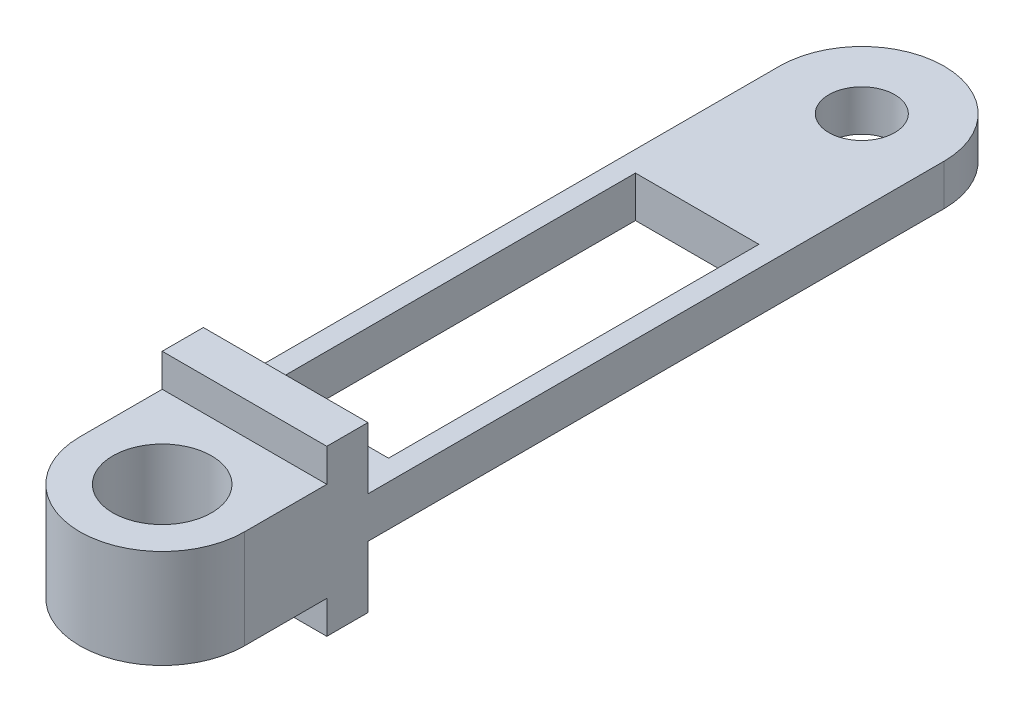
ISO-10303-21;
HEADER;
FILE_DESCRIPTION(('STEP AP214'),'2;1');
FILE_NAME('part.step','',(''),(''),'','','');
FILE_SCHEMA(('AUTOMOTIVE_DESIGN { 1 0 10303 214 1 1 1 1 }'));
ENDSEC;
DATA;
#1=APPLICATION_CONTEXT('core data for automotive mechanical design processes');
#2=APPLICATION_PROTOCOL_DEFINITION('international standard','automotive_design',2000,#1);
#3=PRODUCT_CONTEXT('',#1,'mechanical');
#4=PRODUCT('Part','Part','',(#3));
#5=PRODUCT_RELATED_PRODUCT_CATEGORY('part','',(#4));
#6=PRODUCT_DEFINITION_FORMATION('','',#4);
#7=PRODUCT_DEFINITION_CONTEXT('part definition',#1,'design');
#8=PRODUCT_DEFINITION('design','',#6,#7);
#9=PRODUCT_DEFINITION_SHAPE('','',#8);
#10=(LENGTH_UNIT() NAMED_UNIT(*) SI_UNIT(.MILLI.,.METRE.));
#11=(NAMED_UNIT(*) PLANE_ANGLE_UNIT() SI_UNIT($,.RADIAN.));
#12=(NAMED_UNIT(*) SI_UNIT($,.STERADIAN.) SOLID_ANGLE_UNIT());
#13=UNCERTAINTY_MEASURE_WITH_UNIT(LENGTH_MEASURE(1.E-05),#10,'distance_accuracy_value','');
#14=(GEOMETRIC_REPRESENTATION_CONTEXT(3) GLOBAL_UNCERTAINTY_ASSIGNED_CONTEXT((#13)) GLOBAL_UNIT_ASSIGNED_CONTEXT((#10,
#11,#12)) REPRESENTATION_CONTEXT('',''));
#15=CARTESIAN_POINT('',(0.,0.,0.));
#16=DIRECTION('',(0.,0.,1.));
#17=DIRECTION('',(1.,0.,0.));
#18=AXIS2_PLACEMENT_3D('',#15,#16,#17);
#19=CARTESIAN_POINT('',(0.,0.,5.));
#20=DIRECTION('',(0.,0.,1.));
#21=DIRECTION('',(1.,0.,0.));
#22=AXIS2_PLACEMENT_3D('',#19,#20,#21);
#23=PLANE('',#22);
#24=DIRECTION('',(0.,1.,0.));
#25=VECTOR('',#24,1.);
#26=CARTESIAN_POINT('',(10.,-10.,5.));
#27=LINE('',#26,#25);
#28=CARTESIAN_POINT('',(10.,-10.,5.));
#29=VERTEX_POINT('',#28);
#30=CARTESIAN_POINT('',(10.,-6.,5.));
#31=VERTEX_POINT('',#30);
#32=EDGE_CURVE('E89',#29,#31,#27,.T.);
#33=ORIENTED_EDGE('',*,*,#32,.T.);
#34=DIRECTION('',(-1.,0.,0.));
#35=VECTOR('',#34,1.);
#36=CARTESIAN_POINT('',(-10.,-6.,5.));
#37=LINE('',#36,#35);
#38=CARTESIAN_POINT('',(-9.99999999999999,-6.,5.));
#39=VERTEX_POINT('',#38);
#40=EDGE_CURVE('E225',#31,#39,#37,.T.);
#41=ORIENTED_EDGE('',*,*,#40,.T.);
#42=DIRECTION('',(0.,-1.,0.));
#43=VECTOR('',#42,1.);
#44=CARTESIAN_POINT('',(-9.99999999999999,-10.,5.));
#45=LINE('',#44,#43);
#46=CARTESIAN_POINT('',(-9.99999999999999,-10.,5.));
#47=VERTEX_POINT('',#46);
#48=EDGE_CURVE('E192',#39,#47,#45,.T.);
#49=ORIENTED_EDGE('',*,*,#48,.T.);
#50=DIRECTION('',(1.,0.,0.));
#51=VECTOR('',#50,1.);
#52=CARTESIAN_POINT('',(10.,-10.,5.));
#53=LINE('',#52,#51);
#54=EDGE_CURVE('E191',#47,#29,#53,.T.);
#55=ORIENTED_EDGE('',*,*,#54,.T.);
#56=EDGE_LOOP('',(#33,#41,#49,#55));
#57=FACE_BOUND('',#56,.T.);
#58=ADVANCED_FACE('F63',(#57),#23,.T.);
#59=CARTESIAN_POINT('',(0.,0.,0.));
#60=DIRECTION('',(0.,0.,1.));
#61=DIRECTION('',(1.,0.,0.));
#62=AXIS2_PLACEMENT_3D('',#59,#60,#61);
#63=PLANE('',#62);
#64=DIRECTION('',(1.,0.,0.));
#65=VECTOR('',#64,1.);
#66=CARTESIAN_POINT('',(-10.,2.5,0.));
#67=LINE('',#66,#65);
#68=CARTESIAN_POINT('',(-10.,2.5,0.));
#69=VERTEX_POINT('',#68);
#70=CARTESIAN_POINT('',(10.,2.5,0.));
#71=VERTEX_POINT('',#70);
#72=EDGE_CURVE('E296',#69,#71,#67,.T.);
#73=ORIENTED_EDGE('',*,*,#72,.F.);
#74=DIRECTION('',(0.,-1.,0.));
#75=VECTOR('',#74,1.);
#76=CARTESIAN_POINT('',(-9.99999999999999,-10.,0.));
#77=LINE('',#76,#75);
#78=CARTESIAN_POINT('',(-10.,10.,0.));
#79=VERTEX_POINT('',#78);
#80=EDGE_CURVE('E318',#79,#69,#77,.T.);
#81=ORIENTED_EDGE('',*,*,#80,.F.);
#82=DIRECTION('',(-1.,0.,0.));
#83=VECTOR('',#82,1.);
#84=CARTESIAN_POINT('',(10.,10.,0.));
#85=LINE('',#84,#83);
#86=CARTESIAN_POINT('',(10.,10.,0.));
#87=VERTEX_POINT('',#86);
#88=EDGE_CURVE('E330',#87,#79,#85,.T.);
#89=ORIENTED_EDGE('',*,*,#88,.F.);
#90=DIRECTION('',(0.,1.,0.));
#91=VECTOR('',#90,1.);
#92=CARTESIAN_POINT('',(10.,-10.,0.));
#93=LINE('',#92,#91);
#94=EDGE_CURVE('E325',#71,#87,#93,.T.);
#95=ORIENTED_EDGE('',*,*,#94,.F.);
#96=EDGE_LOOP('',(#73,#81,#89,#95));
#97=FACE_BOUND('',#96,.T.);
#98=ADVANCED_FACE('F400',(#97),#63,.F.);
#99=CARTESIAN_POINT('',(-9.99999999999999,-10.,5.));
#100=DIRECTION('',(1.,0.,0.));
#101=DIRECTION('',(0.,1.,0.));
#102=AXIS2_PLACEMENT_3D('',#99,#100,#101);
#103=PLANE('',#102);
#104=DIRECTION('',(0.,0.,-1.));
#105=VECTOR('',#104,1.);
#106=CARTESIAN_POINT('',(-10.,2.5,0.));
#107=LINE('',#106,#105);
#108=CARTESIAN_POINT('',(-10.,2.5,-70.));
#109=VERTEX_POINT('',#108);
#110=EDGE_CURVE('E289',#69,#109,#107,.T.);
#111=ORIENTED_EDGE('',*,*,#110,.T.);
#112=DIRECTION('',(0.,-1.,0.));
#113=VECTOR('',#112,1.);
#114=CARTESIAN_POINT('',(-9.99999999999999,-2.5,-70.));
#115=LINE('',#114,#113);
#116=CARTESIAN_POINT('',(-10.,-2.5,-70.));
#117=VERTEX_POINT('',#116);
#118=EDGE_CURVE('E12',#109,#117,#115,.T.);
#119=ORIENTED_EDGE('',*,*,#118,.T.);
#120=DIRECTION('',(0.,0.,-1.));
#121=VECTOR('',#120,1.);
#122=CARTESIAN_POINT('',(-10.,-2.5,0.));
#123=LINE('',#122,#121);
#124=CARTESIAN_POINT('',(-9.99999999999999,-2.5,0.));
#125=VERTEX_POINT('',#124);
#126=EDGE_CURVE('E279',#125,#117,#123,.T.);
#127=ORIENTED_EDGE('',*,*,#126,.F.);
#128=CARTESIAN_POINT('',(-9.99999999999999,-10.,0.));
#129=VERTEX_POINT('',#128);
#130=EDGE_CURVE('E300',#125,#129,#77,.T.);
#131=ORIENTED_EDGE('',*,*,#130,.T.);
#132=DIRECTION('',(0.,0.,-1.));
#133=VECTOR('',#132,1.);
#134=CARTESIAN_POINT('',(-9.99999999999999,-10.,5.));
#135=LINE('',#134,#133);
#136=EDGE_CURVE('E343',#47,#129,#135,.T.);
#137=ORIENTED_EDGE('',*,*,#136,.F.);
#138=ORIENTED_EDGE('',*,*,#48,.F.);
#139=DIRECTION('',(0.,0.,1.));
#140=VECTOR('',#139,1.);
#141=CARTESIAN_POINT('',(-10.,-6.,5.));
#142=LINE('',#141,#140);
#143=CARTESIAN_POINT('',(-9.99999999999999,-6.,15.));
#144=VERTEX_POINT('',#143);
#145=EDGE_CURVE('E228',#39,#144,#142,.T.);
#146=ORIENTED_EDGE('',*,*,#145,.T.);
#147=DIRECTION('',(0.,-1.,0.));
#148=VECTOR('',#147,1.);
#149=CARTESIAN_POINT('',(-9.99999999999999,6.,15.));
#150=LINE('',#149,#148);
#151=CARTESIAN_POINT('',(-9.99999999999999,6.,15.));
#152=VERTEX_POINT('',#151);
#153=EDGE_CURVE('E199',#152,#144,#150,.T.);
#154=ORIENTED_EDGE('',*,*,#153,.F.);
#155=DIRECTION('',(0.,0.,1.));
#156=VECTOR('',#155,1.);
#157=CARTESIAN_POINT('',(-10.,6.,5.));
#158=LINE('',#157,#156);
#159=CARTESIAN_POINT('',(-10.,6.,5.));
#160=VERTEX_POINT('',#159);
#161=EDGE_CURVE('E195',#160,#152,#158,.T.);
#162=ORIENTED_EDGE('',*,*,#161,.F.);
#163=CARTESIAN_POINT('',(-10.,10.,5.));
#164=VERTEX_POINT('',#163);
#165=EDGE_CURVE('E182',#164,#160,#45,.T.);
#166=ORIENTED_EDGE('',*,*,#165,.F.);
#167=DIRECTION('',(0.,0.,-1.));
#168=VECTOR('',#167,1.);
#169=CARTESIAN_POINT('',(-10.,10.,5.));
#170=LINE('',#169,#168);
#171=EDGE_CURVE('E317',#164,#79,#170,.T.);
#172=ORIENTED_EDGE('',*,*,#171,.T.);
#173=ORIENTED_EDGE('',*,*,#80,.T.);
#174=EDGE_LOOP('',(#111,#119,#127,#131,#137,#138,#146,#154,#162,#166,#172,#173));
#175=FACE_BOUND('',#174,.T.);
#176=ADVANCED_FACE('F197',(#175),#103,.F.);
#177=CARTESIAN_POINT('',(10.,-10.,5.));
#178=DIRECTION('',(0.,1.,0.));
#179=DIRECTION('',(-1.,0.,0.));
#180=AXIS2_PLACEMENT_3D('',#177,#178,#179);
#181=PLANE('',#180);
#182=DIRECTION('',(1.,0.,0.));
#183=VECTOR('',#182,1.);
#184=CARTESIAN_POINT('',(10.,-10.,0.));
#185=LINE('',#184,#183);
#186=CARTESIAN_POINT('',(10.,-10.,0.));
#187=VERTEX_POINT('',#186);
#188=EDGE_CURVE('E322',#129,#187,#185,.T.);
#189=ORIENTED_EDGE('',*,*,#188,.T.);
#190=DIRECTION('',(0.,0.,-1.));
#191=VECTOR('',#190,1.);
#192=CARTESIAN_POINT('',(10.,-10.,5.));
#193=LINE('',#192,#191);
#194=EDGE_CURVE('E339',#29,#187,#193,.T.);
#195=ORIENTED_EDGE('',*,*,#194,.F.);
#196=ORIENTED_EDGE('',*,*,#54,.F.);
#197=ORIENTED_EDGE('',*,*,#136,.T.);
#198=EDGE_LOOP('',(#189,#195,#196,#197));
#199=FACE_BOUND('',#198,.T.);
#200=ADVANCED_FACE('F416',(#199),#181,.F.);
#201=CARTESIAN_POINT('',(10.,-10.,5.));
#202=DIRECTION('',(-1.,0.,0.));
#203=DIRECTION('',(0.,0.,1.));
#204=AXIS2_PLACEMENT_3D('',#201,#202,#203);
#205=PLANE('',#204);
#206=DIRECTION('',(0.,0.,1.));
#207=VECTOR('',#206,1.);
#208=CARTESIAN_POINT('',(10.,-2.5,-80.));
#209=LINE('',#208,#207);
#210=CARTESIAN_POINT('',(10.,-2.5,-70.));
#211=VERTEX_POINT('',#210);
#212=CARTESIAN_POINT('',(10.,-2.5,0.));
#213=VERTEX_POINT('',#212);
#214=EDGE_CURVE('E304',#211,#213,#209,.T.);
#215=ORIENTED_EDGE('',*,*,#214,.F.);
#216=DIRECTION('',(0.,-1.,0.));
#217=VECTOR('',#216,1.);
#218=CARTESIAN_POINT('',(10.,2.5,-70.));
#219=LINE('',#218,#217);
#220=CARTESIAN_POINT('',(10.,2.5,-70.));
#221=VERTEX_POINT('',#220);
#222=EDGE_CURVE('E353',#211,#221,#219,.F.);
#223=ORIENTED_EDGE('',*,*,#222,.T.);
#224=DIRECTION('',(0.,0.,1.));
#225=VECTOR('',#224,1.);
#226=CARTESIAN_POINT('',(10.,2.5,-80.));
#227=LINE('',#226,#225);
#228=EDGE_CURVE('E292',#221,#71,#227,.T.);
#229=ORIENTED_EDGE('',*,*,#228,.T.);
#230=ORIENTED_EDGE('',*,*,#94,.T.);
#231=DIRECTION('',(0.,0.,-1.));
#232=VECTOR('',#231,1.);
#233=CARTESIAN_POINT('',(10.,10.,5.));
#234=LINE('',#233,#232);
#235=CARTESIAN_POINT('',(10.,10.,5.));
#236=VERTEX_POINT('',#235);
#237=EDGE_CURVE('E335',#236,#87,#234,.T.);
#238=ORIENTED_EDGE('',*,*,#237,.F.);
#239=CARTESIAN_POINT('',(10.,6.,5.));
#240=VERTEX_POINT('',#239);
#241=EDGE_CURVE('E312',#240,#236,#27,.T.);
#242=ORIENTED_EDGE('',*,*,#241,.F.);
#243=DIRECTION('',(0.,0.,-1.));
#244=VECTOR('',#243,1.);
#245=CARTESIAN_POINT('',(10.,6.,5.));
#246=LINE('',#245,#244);
#247=CARTESIAN_POINT('',(10.,6.,15.));
#248=VERTEX_POINT('',#247);
#249=EDGE_CURVE('E209',#248,#240,#246,.T.);
#250=ORIENTED_EDGE('',*,*,#249,.F.);
#251=DIRECTION('',(0.,-1.,0.));
#252=VECTOR('',#251,1.);
#253=CARTESIAN_POINT('',(10.,6.,15.));
#254=LINE('',#253,#252);
#255=CARTESIAN_POINT('',(10.,-6.,15.));
#256=VERTEX_POINT('',#255);
#257=EDGE_CURVE('E224',#248,#256,#254,.T.);
#258=ORIENTED_EDGE('',*,*,#257,.T.);
#259=DIRECTION('',(0.,0.,-1.));
#260=VECTOR('',#259,1.);
#261=CARTESIAN_POINT('',(10.,-6.,5.));
#262=LINE('',#261,#260);
#263=EDGE_CURVE('E211',#256,#31,#262,.T.);
#264=ORIENTED_EDGE('',*,*,#263,.T.);
#265=ORIENTED_EDGE('',*,*,#32,.F.);
#266=ORIENTED_EDGE('',*,*,#194,.T.);
#267=EDGE_CURVE('E326',#187,#213,#93,.T.);
#268=ORIENTED_EDGE('',*,*,#267,.T.);
#269=EDGE_LOOP('',(#215,#223,#229,#230,#238,#242,#250,#258,#264,#265,#266,#268));
#270=FACE_BOUND('',#269,.T.);
#271=ADVANCED_FACE('F394',(#270),#205,.F.);
#272=CARTESIAN_POINT('',(10.,10.,5.));
#273=DIRECTION('',(0.,-1.,0.));
#274=DIRECTION('',(1.,0.,0.));
#275=AXIS2_PLACEMENT_3D('',#272,#273,#274);
#276=PLANE('',#275);
#277=ORIENTED_EDGE('',*,*,#88,.T.);
#278=ORIENTED_EDGE('',*,*,#171,.F.);
#279=DIRECTION('',(-1.,0.,0.));
#280=VECTOR('',#279,1.);
#281=CARTESIAN_POINT('',(10.,10.,5.));
#282=LINE('',#281,#280);
#283=EDGE_CURVE('E186',#236,#164,#282,.T.);
#284=ORIENTED_EDGE('',*,*,#283,.F.);
#285=ORIENTED_EDGE('',*,*,#237,.T.);
#286=EDGE_LOOP('',(#277,#278,#284,#285));
#287=FACE_BOUND('',#286,.T.);
#288=ADVANCED_FACE('F403',(#287),#276,.F.);
#289=DIRECTION('',(-1.,0.,0.));
#290=VECTOR('',#289,1.);
#291=CARTESIAN_POINT('',(-10.,6.,5.));
#292=LINE('',#291,#290);
#293=EDGE_CURVE('E81',#240,#160,#292,.T.);
#294=ORIENTED_EDGE('',*,*,#293,.F.);
#295=ORIENTED_EDGE('',*,*,#241,.T.);
#296=ORIENTED_EDGE('',*,*,#283,.T.);
#297=ORIENTED_EDGE('',*,*,#165,.T.);
#298=EDGE_LOOP('',(#294,#295,#296,#297));
#299=FACE_BOUND('',#298,.T.);
#300=ADVANCED_FACE('F184',(#299),#23,.T.);
#301=ORIENTED_EDGE('',*,*,#130,.F.);
#302=DIRECTION('',(1.,0.,0.));
#303=VECTOR('',#302,1.);
#304=CARTESIAN_POINT('',(-10.,-2.5,0.));
#305=LINE('',#304,#303);
#306=EDGE_CURVE('E293',#125,#213,#305,.T.);
#307=ORIENTED_EDGE('',*,*,#306,.T.);
#308=ORIENTED_EDGE('',*,*,#267,.F.);
#309=ORIENTED_EDGE('',*,*,#188,.F.);
#310=EDGE_LOOP('',(#301,#307,#308,#309));
#311=FACE_BOUND('',#310,.T.);
#312=ADVANCED_FACE('F412',(#311),#63,.F.);
#313=CARTESIAN_POINT('',(0.,2.5,0.));
#314=DIRECTION('',(0.,-1.,0.));
#315=DIRECTION('',(0.,0.,-1.));
#316=AXIS2_PLACEMENT_3D('',#313,#314,#315);
#317=PLANE('',#316);
#318=CARTESIAN_POINT('',(0.,2.5,-70.));
#319=DIRECTION('',(0.,1.,0.));
#320=DIRECTION('',(0.,0.,1.));
#321=AXIS2_PLACEMENT_3D('',#318,#319,#320);
#322=CIRCLE('',#321,4.);
#323=CARTESIAN_POINT('',(0.,2.5,-66.));
#324=VERTEX_POINT('',#323);
#325=EDGE_CURVE('E239',#324,#324,#322,.T.);
#326=ORIENTED_EDGE('',*,*,#325,.F.);
#327=EDGE_LOOP('',(#326));
#328=FACE_BOUND('',#327,.T.);
#329=DIRECTION('',(-1.,0.,0.));
#330=VECTOR('',#329,1.);
#331=CARTESIAN_POINT('',(7.5,2.5,-5.));
#332=LINE('',#331,#330);
#333=CARTESIAN_POINT('',(7.5,2.5,-5.));
#334=VERTEX_POINT('',#333);
#335=CARTESIAN_POINT('',(-7.5,2.5,-5.));
#336=VERTEX_POINT('',#335);
#337=EDGE_CURVE('E256',#334,#336,#332,.T.);
#338=ORIENTED_EDGE('',*,*,#337,.T.);
#339=DIRECTION('',(0.,0.,-1.));
#340=VECTOR('',#339,1.);
#341=CARTESIAN_POINT('',(-7.5,2.5,-5.));
#342=LINE('',#341,#340);
#343=CARTESIAN_POINT('',(-7.50000000000001,2.5,-50.));
#344=VERTEX_POINT('',#343);
#345=EDGE_CURVE('E243',#336,#344,#342,.T.);
#346=ORIENTED_EDGE('',*,*,#345,.T.);
#347=DIRECTION('',(1.,0.,0.));
#348=VECTOR('',#347,1.);
#349=CARTESIAN_POINT('',(-7.50000000000001,2.5,-50.));
#350=LINE('',#349,#348);
#351=CARTESIAN_POINT('',(7.5,2.5,-50.));
#352=VERTEX_POINT('',#351);
#353=EDGE_CURVE('E247',#344,#352,#350,.T.);
#354=ORIENTED_EDGE('',*,*,#353,.T.);
#355=DIRECTION('',(0.,0.,1.));
#356=VECTOR('',#355,1.);
#357=CARTESIAN_POINT('',(7.5,2.5,-50.));
#358=LINE('',#357,#356);
#359=EDGE_CURVE('E252',#352,#334,#358,.T.);
#360=ORIENTED_EDGE('',*,*,#359,.T.);
#361=EDGE_LOOP('',(#338,#346,#354,#360));
#362=FACE_BOUND('',#361,.T.);
#363=ORIENTED_EDGE('',*,*,#228,.F.);
#364=CARTESIAN_POINT('',(0.,2.5,-70.));
#365=DIRECTION('',(0.,-1.,0.));
#366=DIRECTION('',(0.,0.,-1.));
#367=AXIS2_PLACEMENT_3D('',#364,#365,#366);
#368=CIRCLE('',#367,10.);
#369=CARTESIAN_POINT('',(0.,2.5,-80.));
#370=VERTEX_POINT('',#369);
#371=EDGE_CURVE('E73',#221,#370,#368,.F.);
#372=ORIENTED_EDGE('',*,*,#371,.T.);
#373=CARTESIAN_POINT('',(0.,2.5,-70.));
#374=DIRECTION('',(0.,-1.,0.));
#375=DIRECTION('',(0.,0.,-1.));
#376=AXIS2_PLACEMENT_3D('',#373,#374,#375);
#377=CIRCLE('',#376,10.);
#378=EDGE_CURVE('E357',#370,#109,#377,.F.);
#379=ORIENTED_EDGE('',*,*,#378,.T.);
#380=ORIENTED_EDGE('',*,*,#110,.F.);
#381=ORIENTED_EDGE('',*,*,#72,.T.);
#382=EDGE_LOOP('',(#363,#372,#379,#380,#381));
#383=FACE_BOUND('',#382,.T.);
#384=ADVANCED_FACE('F377',(#328,#362,#383),#317,.F.);
#385=CARTESIAN_POINT('',(0.,-2.5,0.));
#386=DIRECTION('',(0.,-1.,0.));
#387=DIRECTION('',(0.,0.,-1.));
#388=AXIS2_PLACEMENT_3D('',#385,#386,#387);
#389=PLANE('',#388);
#390=CARTESIAN_POINT('',(0.,-2.5,-70.));
#391=DIRECTION('',(0.,-1.,0.));
#392=DIRECTION('',(0.,0.,-1.));
#393=AXIS2_PLACEMENT_3D('',#390,#391,#392);
#394=CIRCLE('',#393,4.);
#395=CARTESIAN_POINT('',(0.,-2.5,-74.));
#396=VERTEX_POINT('',#395);
#397=EDGE_CURVE('E67',#396,#396,#394,.T.);
#398=ORIENTED_EDGE('',*,*,#397,.F.);
#399=EDGE_LOOP('',(#398));
#400=FACE_BOUND('',#399,.T.);
#401=DIRECTION('',(0.,0.,-1.));
#402=VECTOR('',#401,1.);
#403=CARTESIAN_POINT('',(-7.5,-2.5,-5.));
#404=LINE('',#403,#402);
#405=CARTESIAN_POINT('',(-7.5,-2.5,-5.));
#406=VERTEX_POINT('',#405);
#407=CARTESIAN_POINT('',(-7.50000000000001,-2.5,-50.));
#408=VERTEX_POINT('',#407);
#409=EDGE_CURVE('E261',#406,#408,#404,.T.);
#410=ORIENTED_EDGE('',*,*,#409,.F.);
#411=DIRECTION('',(-1.,0.,0.));
#412=VECTOR('',#411,1.);
#413=CARTESIAN_POINT('',(7.5,-2.5,-5.));
#414=LINE('',#413,#412);
#415=CARTESIAN_POINT('',(7.5,-2.5,-5.));
#416=VERTEX_POINT('',#415);
#417=EDGE_CURVE('E248',#416,#406,#414,.T.);
#418=ORIENTED_EDGE('',*,*,#417,.F.);
#419=DIRECTION('',(0.,0.,1.));
#420=VECTOR('',#419,1.);
#421=CARTESIAN_POINT('',(7.5,-2.5,-50.));
#422=LINE('',#421,#420);
#423=CARTESIAN_POINT('',(7.5,-2.5,-50.));
#424=VERTEX_POINT('',#423);
#425=EDGE_CURVE('E269',#424,#416,#422,.T.);
#426=ORIENTED_EDGE('',*,*,#425,.F.);
#427=DIRECTION('',(1.,0.,0.));
#428=VECTOR('',#427,1.);
#429=CARTESIAN_POINT('',(-7.50000000000001,-2.5,-50.));
#430=LINE('',#429,#428);
#431=EDGE_CURVE('E264',#408,#424,#430,.T.);
#432=ORIENTED_EDGE('',*,*,#431,.F.);
#433=EDGE_LOOP('',(#410,#418,#426,#432));
#434=FACE_BOUND('',#433,.T.);
#435=CARTESIAN_POINT('',(0.,-2.5,-70.));
#436=DIRECTION('',(0.,-1.,0.));
#437=DIRECTION('',(0.,0.,-1.));
#438=AXIS2_PLACEMENT_3D('',#435,#436,#437);
#439=CIRCLE('',#438,10.);
#440=CARTESIAN_POINT('',(0.,-2.5,-80.));
#441=VERTEX_POINT('',#440);
#442=EDGE_CURVE('E347',#117,#441,#439,.T.);
#443=ORIENTED_EDGE('',*,*,#442,.T.);
#444=CARTESIAN_POINT('',(0.,-2.5,-70.));
#445=DIRECTION('',(0.,-1.,0.));
#446=DIRECTION('',(0.,0.,-1.));
#447=AXIS2_PLACEMENT_3D('',#444,#445,#446);
#448=CIRCLE('',#447,10.);
#449=EDGE_CURVE('E350',#441,#211,#448,.T.);
#450=ORIENTED_EDGE('',*,*,#449,.T.);
#451=ORIENTED_EDGE('',*,*,#214,.T.);
#452=ORIENTED_EDGE('',*,*,#306,.F.);
#453=ORIENTED_EDGE('',*,*,#126,.T.);
#454=EDGE_LOOP('',(#443,#450,#451,#452,#453));
#455=FACE_BOUND('',#454,.T.);
#456=ADVANCED_FACE('F373',(#400,#434,#455),#389,.T.);
#457=CARTESIAN_POINT('',(-7.5,2.5,-5.));
#458=DIRECTION('',(-1.,0.,0.));
#459=DIRECTION('',(0.,0.,1.));
#460=AXIS2_PLACEMENT_3D('',#457,#458,#459);
#461=PLANE('',#460);
#462=ORIENTED_EDGE('',*,*,#409,.T.);
#463=DIRECTION('',(0.,-1.,0.));
#464=VECTOR('',#463,1.);
#465=CARTESIAN_POINT('',(-7.50000000000001,2.5,-50.));
#466=LINE('',#465,#464);
#467=EDGE_CURVE('E260',#344,#408,#466,.T.);
#468=ORIENTED_EDGE('',*,*,#467,.F.);
#469=ORIENTED_EDGE('',*,*,#345,.F.);
#470=DIRECTION('',(0.,-1.,0.));
#471=VECTOR('',#470,1.);
#472=CARTESIAN_POINT('',(-7.5,2.5,-5.));
#473=LINE('',#472,#471);
#474=EDGE_CURVE('E276',#336,#406,#473,.T.);
#475=ORIENTED_EDGE('',*,*,#474,.T.);
#476=EDGE_LOOP('',(#462,#468,#469,#475));
#477=FACE_BOUND('',#476,.T.);
#478=ADVANCED_FACE('F376',(#477),#461,.F.);
#479=CARTESIAN_POINT('',(7.5,2.5,-5.));
#480=DIRECTION('',(0.,0.,1.));
#481=DIRECTION('',(1.,0.,0.));
#482=AXIS2_PLACEMENT_3D('',#479,#480,#481);
#483=PLANE('',#482);
#484=ORIENTED_EDGE('',*,*,#417,.T.);
#485=ORIENTED_EDGE('',*,*,#474,.F.);
#486=ORIENTED_EDGE('',*,*,#337,.F.);
#487=DIRECTION('',(0.,-1.,0.));
#488=VECTOR('',#487,1.);
#489=CARTESIAN_POINT('',(7.5,2.5,-5.));
#490=LINE('',#489,#488);
#491=EDGE_CURVE('E280',#334,#416,#490,.T.);
#492=ORIENTED_EDGE('',*,*,#491,.T.);
#493=EDGE_LOOP('',(#484,#485,#486,#492));
#494=FACE_BOUND('',#493,.T.);
#495=ADVANCED_FACE('F475',(#494),#483,.F.);
#496=CARTESIAN_POINT('',(7.5,2.5,-50.));
#497=DIRECTION('',(1.,0.,0.));
#498=DIRECTION('',(0.,0.,-1.));
#499=AXIS2_PLACEMENT_3D('',#496,#497,#498);
#500=PLANE('',#499);
#501=ORIENTED_EDGE('',*,*,#425,.T.);
#502=ORIENTED_EDGE('',*,*,#491,.F.);
#503=ORIENTED_EDGE('',*,*,#359,.F.);
#504=DIRECTION('',(0.,-1.,0.));
#505=VECTOR('',#504,1.);
#506=CARTESIAN_POINT('',(7.5,2.5,-50.));
#507=LINE('',#506,#505);
#508=EDGE_CURVE('E283',#352,#424,#507,.T.);
#509=ORIENTED_EDGE('',*,*,#508,.T.);
#510=EDGE_LOOP('',(#501,#502,#503,#509));
#511=FACE_BOUND('',#510,.T.);
#512=ADVANCED_FACE('F469',(#511),#500,.F.);
#513=CARTESIAN_POINT('',(-7.50000000000001,2.5,-50.));
#514=DIRECTION('',(0.,0.,-1.));
#515=DIRECTION('',(-1.,0.,0.));
#516=AXIS2_PLACEMENT_3D('',#513,#514,#515);
#517=PLANE('',#516);
#518=ORIENTED_EDGE('',*,*,#431,.T.);
#519=ORIENTED_EDGE('',*,*,#508,.F.);
#520=ORIENTED_EDGE('',*,*,#353,.F.);
#521=ORIENTED_EDGE('',*,*,#467,.T.);
#522=EDGE_LOOP('',(#518,#519,#520,#521));
#523=FACE_BOUND('',#522,.T.);
#524=ADVANCED_FACE('F465',(#523),#517,.F.);
#525=CARTESIAN_POINT('',(0.,-10.,-70.));
#526=DIRECTION('',(0.,1.,0.));
#527=DIRECTION('',(-1.,0.,0.));
#528=AXIS2_PLACEMENT_3D('',#525,#526,#527);
#529=CYLINDRICAL_SURFACE('',#528,10.);
#530=ORIENTED_EDGE('',*,*,#118,.F.);
#531=ORIENTED_EDGE('',*,*,#378,.F.);
#532=DIRECTION('',(0.,-1.,0.));
#533=VECTOR('',#532,1.);
#534=CARTESIAN_POINT('',(0.,2.5,-80.));
#535=LINE('',#534,#533);
#536=EDGE_CURVE('E265',#441,#370,#535,.F.);
#537=ORIENTED_EDGE('',*,*,#536,.F.);
#538=ORIENTED_EDGE('',*,*,#442,.F.);
#539=EDGE_LOOP('',(#530,#531,#537,#538));
#540=FACE_BOUND('',#539,.T.);
#541=ADVANCED_FACE('F65',(#540),#529,.T.);
#542=CARTESIAN_POINT('',(0.,2.5,-70.));
#543=DIRECTION('',(0.,1.,0.));
#544=DIRECTION('',(0.,0.,1.));
#545=AXIS2_PLACEMENT_3D('',#542,#543,#544);
#546=CYLINDRICAL_SURFACE('',#545,10.);
#547=ORIENTED_EDGE('',*,*,#371,.F.);
#548=ORIENTED_EDGE('',*,*,#222,.F.);
#549=ORIENTED_EDGE('',*,*,#449,.F.);
#550=ORIENTED_EDGE('',*,*,#536,.T.);
#551=EDGE_LOOP('',(#547,#548,#549,#550));
#552=FACE_BOUND('',#551,.T.);
#553=ADVANCED_FACE('F391',(#552),#546,.T.);
#554=CARTESIAN_POINT('',(0.,-10.,-70.));
#555=DIRECTION('',(0.,1.,0.));
#556=DIRECTION('',(0.,0.,1.));
#557=AXIS2_PLACEMENT_3D('',#554,#555,#556);
#558=CYLINDRICAL_SURFACE('',#557,4.);
#559=ORIENTED_EDGE('',*,*,#397,.T.);
#560=EDGE_LOOP('',(#559));
#561=FACE_BOUND('',#560,.T.);
#562=ORIENTED_EDGE('',*,*,#325,.T.);
#563=EDGE_LOOP('',(#562));
#564=FACE_BOUND('',#563,.T.);
#565=ADVANCED_FACE('F370',(#561,#564),#558,.F.);
#566=CARTESIAN_POINT('',(0.,6.,15.));
#567=DIRECTION('',(0.,1.,0.));
#568=DIRECTION('',(0.,0.,1.));
#569=AXIS2_PLACEMENT_3D('',#566,#567,#568);
#570=PLANE('',#569);
#571=ORIENTED_EDGE('',*,*,#293,.T.);
#572=ORIENTED_EDGE('',*,*,#161,.T.);
#573=CARTESIAN_POINT('',(0.,6.,15.));
#574=DIRECTION('',(0.,1.,0.));
#575=DIRECTION('',(0.,0.,1.));
#576=AXIS2_PLACEMENT_3D('',#573,#574,#575);
#577=CIRCLE('',#576,10.);
#578=EDGE_CURVE('E203',#152,#248,#577,.T.);
#579=ORIENTED_EDGE('',*,*,#578,.T.);
#580=ORIENTED_EDGE('',*,*,#249,.T.);
#581=EDGE_LOOP('',(#571,#572,#579,#580));
#582=FACE_BOUND('',#581,.T.);
#583=CARTESIAN_POINT('',(0.,6.,15.));
#584=DIRECTION('',(0.,1.,0.));
#585=DIRECTION('',(0.,0.,1.));
#586=AXIS2_PLACEMENT_3D('',#583,#584,#585);
#587=CIRCLE('',#586,6.);
#588=CARTESIAN_POINT('',(0.,6.,21.));
#589=VERTEX_POINT('',#588);
#590=EDGE_CURVE('E229',#589,#589,#587,.T.);
#591=ORIENTED_EDGE('',*,*,#590,.F.);
#592=EDGE_LOOP('',(#591));
#593=FACE_BOUND('',#592,.T.);
#594=ADVANCED_FACE('F206',(#582,#593),#570,.T.);
#595=CARTESIAN_POINT('',(0.,-6.,15.));
#596=DIRECTION('',(0.,1.,0.));
#597=DIRECTION('',(0.,0.,1.));
#598=AXIS2_PLACEMENT_3D('',#595,#596,#597);
#599=PLANE('',#598);
#600=ORIENTED_EDGE('',*,*,#40,.F.);
#601=ORIENTED_EDGE('',*,*,#263,.F.);
#602=CARTESIAN_POINT('',(0.,-6.,15.));
#603=DIRECTION('',(0.,1.,0.));
#604=DIRECTION('',(0.,0.,1.));
#605=AXIS2_PLACEMENT_3D('',#602,#603,#604);
#606=CIRCLE('',#605,10.);
#607=EDGE_CURVE('E214',#144,#256,#606,.T.);
#608=ORIENTED_EDGE('',*,*,#607,.F.);
#609=ORIENTED_EDGE('',*,*,#145,.F.);
#610=EDGE_LOOP('',(#600,#601,#608,#609));
#611=FACE_BOUND('',#610,.T.);
#612=CARTESIAN_POINT('',(0.,-6.,15.));
#613=DIRECTION('',(0.,1.,0.));
#614=DIRECTION('',(0.,0.,1.));
#615=AXIS2_PLACEMENT_3D('',#612,#613,#614);
#616=CIRCLE('',#615,6.);
#617=CARTESIAN_POINT('',(0.,-6.,21.));
#618=VERTEX_POINT('',#617);
#619=EDGE_CURVE('E217',#618,#618,#616,.T.);
#620=ORIENTED_EDGE('',*,*,#619,.T.);
#621=EDGE_LOOP('',(#620));
#622=FACE_BOUND('',#621,.T.);
#623=ADVANCED_FACE('F423',(#611,#622),#599,.F.);
#624=CARTESIAN_POINT('',(0.,6.,15.));
#625=DIRECTION('',(0.,-1.,0.));
#626=DIRECTION('',(0.,0.,-1.));
#627=AXIS2_PLACEMENT_3D('',#624,#625,#626);
#628=CYLINDRICAL_SURFACE('',#627,10.);
#629=ORIENTED_EDGE('',*,*,#607,.T.);
#630=ORIENTED_EDGE('',*,*,#257,.F.);
#631=ORIENTED_EDGE('',*,*,#578,.F.);
#632=ORIENTED_EDGE('',*,*,#153,.T.);
#633=EDGE_LOOP('',(#629,#630,#631,#632));
#634=FACE_BOUND('',#633,.T.);
#635=ADVANCED_FACE('F428',(#634),#628,.T.);
#636=CARTESIAN_POINT('',(0.,6.,15.));
#637=DIRECTION('',(0.,-1.,0.));
#638=DIRECTION('',(0.,0.,-1.));
#639=AXIS2_PLACEMENT_3D('',#636,#637,#638);
#640=CYLINDRICAL_SURFACE('',#639,6.);
#641=ORIENTED_EDGE('',*,*,#590,.T.);
#642=EDGE_LOOP('',(#641));
#643=FACE_BOUND('',#642,.T.);
#644=ORIENTED_EDGE('',*,*,#619,.F.);
#645=EDGE_LOOP('',(#644));
#646=FACE_BOUND('',#645,.T.);
#647=ADVANCED_FACE('F430',(#643,#646),#640,.F.);
#648=CLOSED_SHELL('',(#58,#98,#176,#200,#271,#288,#300,#312,#384,#456,#478,#495,#512,#524,#541,
#553,#565,#594,#623,#635,#647));
#649=MANIFOLD_SOLID_BREP('B2',#648);
#650=ADVANCED_BREP_SHAPE_REPRESENTATION('',(#18,#649),#14);
#651=SHAPE_DEFINITION_REPRESENTATION(#9,#650);
ENDSEC;
END-ISO-10303-21;
